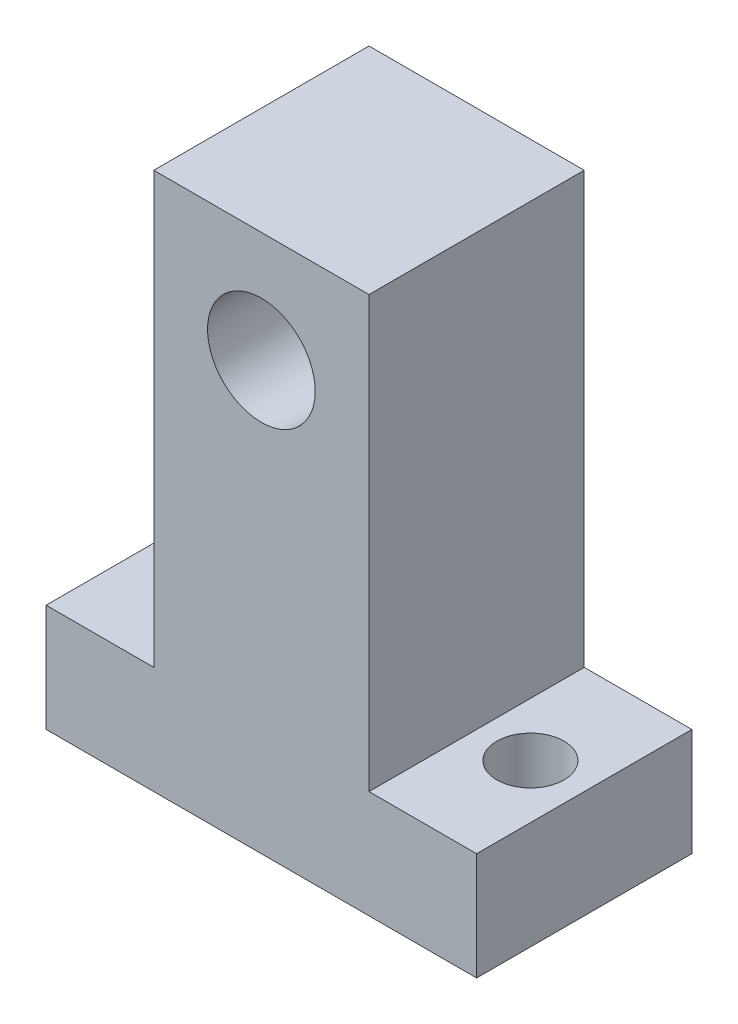
ISO-10303-21;
HEADER;
FILE_DESCRIPTION(('STEP AP214'),'2;1');
FILE_NAME('part.step','',(''),(''),'','','');
FILE_SCHEMA(('AUTOMOTIVE_DESIGN { 1 0 10303 214 1 1 1 1 }'));
ENDSEC;
DATA;
#1=APPLICATION_CONTEXT('core data for automotive mechanical design processes');
#2=APPLICATION_PROTOCOL_DEFINITION('international standard','automotive_design',2000,#1);
#3=PRODUCT_CONTEXT('',#1,'mechanical');
#4=PRODUCT('Part','Part','',(#3));
#5=PRODUCT_RELATED_PRODUCT_CATEGORY('part','',(#4));
#6=PRODUCT_DEFINITION_FORMATION('','',#4);
#7=PRODUCT_DEFINITION_CONTEXT('part definition',#1,'design');
#8=PRODUCT_DEFINITION('design','',#6,#7);
#9=PRODUCT_DEFINITION_SHAPE('','',#8);
#10=(LENGTH_UNIT() NAMED_UNIT(*) SI_UNIT(.MILLI.,.METRE.));
#11=(NAMED_UNIT(*) PLANE_ANGLE_UNIT() SI_UNIT($,.RADIAN.));
#12=(NAMED_UNIT(*) SI_UNIT($,.STERADIAN.) SOLID_ANGLE_UNIT());
#13=UNCERTAINTY_MEASURE_WITH_UNIT(LENGTH_MEASURE(1.E-05),#10,'distance_accuracy_value','');
#14=(GEOMETRIC_REPRESENTATION_CONTEXT(3) GLOBAL_UNCERTAINTY_ASSIGNED_CONTEXT((#13)) GLOBAL_UNIT_ASSIGNED_CONTEXT((#10,
#11,#12)) REPRESENTATION_CONTEXT('',''));
#15=CARTESIAN_POINT('',(0.,0.,0.));
#16=DIRECTION('',(0.,0.,1.));
#17=DIRECTION('',(1.,0.,0.));
#18=AXIS2_PLACEMENT_3D('',#15,#16,#17);
#19=CARTESIAN_POINT('',(0.,0.,16.));
#20=DIRECTION('',(0.,1.,0.));
#21=DIRECTION('',(0.,0.,1.));
#22=AXIS2_PLACEMENT_3D('',#19,#20,#21);
#23=PLANE('',#22);
#24=DIRECTION('',(1.,0.,0.));
#25=VECTOR('',#24,1.);
#26=CARTESIAN_POINT('',(0.,0.,0.));
#27=LINE('',#26,#25);
#28=CARTESIAN_POINT('',(-16.,0.,0.));
#29=VERTEX_POINT('',#28);
#30=CARTESIAN_POINT('',(16.,0.,0.));
#31=VERTEX_POINT('',#30);
#32=EDGE_CURVE('E88',#29,#31,#27,.T.);
#33=ORIENTED_EDGE('',*,*,#32,.T.);
#34=DIRECTION('',(0.,0.,-1.));
#35=VECTOR('',#34,1.);
#36=CARTESIAN_POINT('',(16.,0.,16.));
#37=LINE('',#36,#35);
#38=CARTESIAN_POINT('',(16.,0.,16.));
#39=VERTEX_POINT('',#38);
#40=EDGE_CURVE('E11',#39,#31,#37,.T.);
#41=ORIENTED_EDGE('',*,*,#40,.F.);
#42=DIRECTION('',(1.,0.,0.));
#43=VECTOR('',#42,1.);
#44=CARTESIAN_POINT('',(-16.,0.,16.));
#45=LINE('',#44,#43);
#46=CARTESIAN_POINT('',(-16.,0.,16.));
#47=VERTEX_POINT('',#46);
#48=EDGE_CURVE('E94',#47,#39,#45,.T.);
#49=ORIENTED_EDGE('',*,*,#48,.F.);
#50=DIRECTION('',(0.,0.,-1.));
#51=VECTOR('',#50,1.);
#52=CARTESIAN_POINT('',(-16.,0.,16.));
#53=LINE('',#52,#51);
#54=EDGE_CURVE('E128',#47,#29,#53,.T.);
#55=ORIENTED_EDGE('',*,*,#54,.T.);
#56=EDGE_LOOP('',(#33,#41,#49,#55));
#57=FACE_BOUND('',#56,.T.);
#58=CARTESIAN_POINT('',(12.,0.,8.));
#59=DIRECTION('',(0.,1.,0.));
#60=DIRECTION('',(-1.,0.,0.));
#61=AXIS2_PLACEMENT_3D('',#58,#59,#60);
#62=CIRCLE('',#61,2.5);
#63=CARTESIAN_POINT('',(9.5,0.,8.));
#64=VERTEX_POINT('',#63);
#65=EDGE_CURVE('E185',#64,#64,#62,.F.);
#66=ORIENTED_EDGE('',*,*,#65,.F.);
#67=EDGE_LOOP('',(#66));
#68=FACE_BOUND('',#67,.T.);
#69=CARTESIAN_POINT('',(-12.,0.,8.));
#70=DIRECTION('',(0.,1.,0.));
#71=DIRECTION('',(-1.,0.,0.));
#72=AXIS2_PLACEMENT_3D('',#69,#70,#71);
#73=CIRCLE('',#72,2.5);
#74=CARTESIAN_POINT('',(-14.5,0.,8.));
#75=VERTEX_POINT('',#74);
#76=EDGE_CURVE('E134',#75,#75,#73,.T.);
#77=ORIENTED_EDGE('',*,*,#76,.T.);
#78=EDGE_LOOP('',(#77));
#79=FACE_BOUND('',#78,.T.);
#80=ADVANCED_FACE('F35',(#57,#68,#79),#23,.F.);
#81=CARTESIAN_POINT('',(16.,0.,16.));
#82=DIRECTION('',(-1.,0.,0.));
#83=DIRECTION('',(0.,0.,1.));
#84=AXIS2_PLACEMENT_3D('',#81,#82,#83);
#85=PLANE('',#84);
#86=DIRECTION('',(0.,1.,0.));
#87=VECTOR('',#86,1.);
#88=CARTESIAN_POINT('',(16.,0.,0.));
#89=LINE('',#88,#87);
#90=CARTESIAN_POINT('',(16.,8.,0.));
#91=VERTEX_POINT('',#90);
#92=EDGE_CURVE('E133',#31,#91,#89,.T.);
#93=ORIENTED_EDGE('',*,*,#92,.T.);
#94=DIRECTION('',(0.,0.,-1.));
#95=VECTOR('',#94,1.);
#96=CARTESIAN_POINT('',(16.,8.,16.));
#97=LINE('',#96,#95);
#98=CARTESIAN_POINT('',(16.,8.,16.));
#99=VERTEX_POINT('',#98);
#100=EDGE_CURVE('E44',#99,#91,#97,.T.);
#101=ORIENTED_EDGE('',*,*,#100,.F.);
#102=DIRECTION('',(0.,1.,0.));
#103=VECTOR('',#102,1.);
#104=CARTESIAN_POINT('',(16.,0.,16.));
#105=LINE('',#104,#103);
#106=EDGE_CURVE('E179',#39,#99,#105,.T.);
#107=ORIENTED_EDGE('',*,*,#106,.F.);
#108=ORIENTED_EDGE('',*,*,#40,.T.);
#109=EDGE_LOOP('',(#93,#101,#107,#108));
#110=FACE_BOUND('',#109,.T.);
#111=ADVANCED_FACE('F213',(#110),#85,.F.);
#112=CARTESIAN_POINT('',(16.,8.,16.));
#113=DIRECTION('',(0.,-1.,0.));
#114=DIRECTION('',(1.,0.,0.));
#115=AXIS2_PLACEMENT_3D('',#112,#113,#114);
#116=PLANE('',#115);
#117=CARTESIAN_POINT('',(12.,8.00000000000001,8.));
#118=DIRECTION('',(0.,1.,0.));
#119=DIRECTION('',(-1.,0.,0.));
#120=AXIS2_PLACEMENT_3D('',#117,#118,#119);
#121=CIRCLE('',#120,2.5);
#122=CARTESIAN_POINT('',(9.5,8.00000000000001,8.));
#123=VERTEX_POINT('',#122);
#124=EDGE_CURVE('E182',#123,#123,#121,.F.);
#125=ORIENTED_EDGE('',*,*,#124,.T.);
#126=EDGE_LOOP('',(#125));
#127=FACE_BOUND('',#126,.T.);
#128=DIRECTION('',(-1.,0.,0.));
#129=VECTOR('',#128,1.);
#130=CARTESIAN_POINT('',(16.,8.,0.));
#131=LINE('',#130,#129);
#132=CARTESIAN_POINT('',(8.,8.,0.));
#133=VERTEX_POINT('',#132);
#134=EDGE_CURVE('E136',#91,#133,#131,.T.);
#135=ORIENTED_EDGE('',*,*,#134,.T.);
#136=DIRECTION('',(0.,0.,-1.));
#137=VECTOR('',#136,1.);
#138=CARTESIAN_POINT('',(8.,8.,16.));
#139=LINE('',#138,#137);
#140=CARTESIAN_POINT('',(8.,8.,16.));
#141=VERTEX_POINT('',#140);
#142=EDGE_CURVE('E153',#141,#133,#139,.T.);
#143=ORIENTED_EDGE('',*,*,#142,.F.);
#144=DIRECTION('',(-1.,0.,0.));
#145=VECTOR('',#144,1.);
#146=CARTESIAN_POINT('',(16.,8.,16.));
#147=LINE('',#146,#145);
#148=EDGE_CURVE('E163',#99,#141,#147,.T.);
#149=ORIENTED_EDGE('',*,*,#148,.F.);
#150=ORIENTED_EDGE('',*,*,#100,.T.);
#151=EDGE_LOOP('',(#135,#143,#149,#150));
#152=FACE_BOUND('',#151,.T.);
#153=ADVANCED_FACE('F161',(#127,#152),#116,.F.);
#154=CARTESIAN_POINT('',(8.,8.,16.));
#155=DIRECTION('',(-1.,0.,0.));
#156=DIRECTION('',(0.,0.,1.));
#157=AXIS2_PLACEMENT_3D('',#154,#155,#156);
#158=PLANE('',#157);
#159=DIRECTION('',(0.,1.,0.));
#160=VECTOR('',#159,1.);
#161=CARTESIAN_POINT('',(8.,8.,0.));
#162=LINE('',#161,#160);
#163=CARTESIAN_POINT('',(8.,40.,0.));
#164=VERTEX_POINT('',#163);
#165=EDGE_CURVE('E138',#133,#164,#162,.T.);
#166=ORIENTED_EDGE('',*,*,#165,.T.);
#167=DIRECTION('',(0.,0.,-1.));
#168=VECTOR('',#167,1.);
#169=CARTESIAN_POINT('',(8.,40.,16.));
#170=LINE('',#169,#168);
#171=CARTESIAN_POINT('',(8.,40.,16.));
#172=VERTEX_POINT('',#171);
#173=EDGE_CURVE('E150',#172,#164,#170,.T.);
#174=ORIENTED_EDGE('',*,*,#173,.F.);
#175=DIRECTION('',(0.,1.,0.));
#176=VECTOR('',#175,1.);
#177=CARTESIAN_POINT('',(8.,8.,16.));
#178=LINE('',#177,#176);
#179=EDGE_CURVE('E175',#141,#172,#178,.T.);
#180=ORIENTED_EDGE('',*,*,#179,.F.);
#181=ORIENTED_EDGE('',*,*,#142,.T.);
#182=EDGE_LOOP('',(#166,#174,#180,#181));
#183=FACE_BOUND('',#182,.T.);
#184=ADVANCED_FACE('F171',(#183),#158,.F.);
#185=CARTESIAN_POINT('',(8.,40.,16.));
#186=DIRECTION('',(0.,-1.,0.));
#187=DIRECTION('',(0.,0.,-1.));
#188=AXIS2_PLACEMENT_3D('',#185,#186,#187);
#189=PLANE('',#188);
#190=DIRECTION('',(-1.,0.,0.));
#191=VECTOR('',#190,1.);
#192=CARTESIAN_POINT('',(8.,40.,0.));
#193=LINE('',#192,#191);
#194=CARTESIAN_POINT('',(-8.,40.,0.));
#195=VERTEX_POINT('',#194);
#196=EDGE_CURVE('E140',#164,#195,#193,.T.);
#197=ORIENTED_EDGE('',*,*,#196,.T.);
#198=DIRECTION('',(0.,0.,-1.));
#199=VECTOR('',#198,1.);
#200=CARTESIAN_POINT('',(-8.,40.,16.));
#201=LINE('',#200,#199);
#202=CARTESIAN_POINT('',(-8.,40.,16.));
#203=VERTEX_POINT('',#202);
#204=EDGE_CURVE('E123',#203,#195,#201,.T.);
#205=ORIENTED_EDGE('',*,*,#204,.F.);
#206=DIRECTION('',(-1.,0.,0.));
#207=VECTOR('',#206,1.);
#208=CARTESIAN_POINT('',(8.,40.,16.));
#209=LINE('',#208,#207);
#210=EDGE_CURVE('E114',#172,#203,#209,.T.);
#211=ORIENTED_EDGE('',*,*,#210,.F.);
#212=ORIENTED_EDGE('',*,*,#173,.T.);
#213=EDGE_LOOP('',(#197,#205,#211,#212));
#214=FACE_BOUND('',#213,.T.);
#215=ADVANCED_FACE('F174',(#214),#189,.F.);
#216=CARTESIAN_POINT('',(-8.,40.,16.));
#217=DIRECTION('',(1.,0.,0.));
#218=DIRECTION('',(0.,1.,0.));
#219=AXIS2_PLACEMENT_3D('',#216,#217,#218);
#220=PLANE('',#219);
#221=DIRECTION('',(0.,-1.,0.));
#222=VECTOR('',#221,1.);
#223=CARTESIAN_POINT('',(-8.,40.,0.));
#224=LINE('',#223,#222);
#225=CARTESIAN_POINT('',(-8.,8.,0.));
#226=VERTEX_POINT('',#225);
#227=EDGE_CURVE('E122',#195,#226,#224,.T.);
#228=ORIENTED_EDGE('',*,*,#227,.T.);
#229=DIRECTION('',(0.,0.,-1.));
#230=VECTOR('',#229,1.);
#231=CARTESIAN_POINT('',(-8.,8.,16.));
#232=LINE('',#231,#230);
#233=CARTESIAN_POINT('',(-8.,8.,16.));
#234=VERTEX_POINT('',#233);
#235=EDGE_CURVE('E119',#234,#226,#232,.T.);
#236=ORIENTED_EDGE('',*,*,#235,.F.);
#237=DIRECTION('',(0.,-1.,0.));
#238=VECTOR('',#237,1.);
#239=CARTESIAN_POINT('',(-8.,40.,16.));
#240=LINE('',#239,#238);
#241=EDGE_CURVE('E108',#203,#234,#240,.T.);
#242=ORIENTED_EDGE('',*,*,#241,.F.);
#243=ORIENTED_EDGE('',*,*,#204,.T.);
#244=EDGE_LOOP('',(#228,#236,#242,#243));
#245=FACE_BOUND('',#244,.T.);
#246=ADVANCED_FACE('F120',(#245),#220,.F.);
#247=CARTESIAN_POINT('',(-8.,8.,16.));
#248=DIRECTION('',(0.,-1.,0.));
#249=DIRECTION('',(1.,0.,0.));
#250=AXIS2_PLACEMENT_3D('',#247,#248,#249);
#251=PLANE('',#250);
#252=CARTESIAN_POINT('',(-12.,8.,8.));
#253=DIRECTION('',(0.,1.,0.));
#254=DIRECTION('',(-1.,0.,0.));
#255=AXIS2_PLACEMENT_3D('',#252,#253,#254);
#256=CIRCLE('',#255,2.5);
#257=CARTESIAN_POINT('',(-14.5,8.,8.));
#258=VERTEX_POINT('',#257);
#259=EDGE_CURVE('E188',#258,#258,#256,.T.);
#260=ORIENTED_EDGE('',*,*,#259,.F.);
#261=EDGE_LOOP('',(#260));
#262=FACE_BOUND('',#261,.T.);
#263=DIRECTION('',(-1.,0.,0.));
#264=VECTOR('',#263,1.);
#265=CARTESIAN_POINT('',(-8.,8.,0.));
#266=LINE('',#265,#264);
#267=CARTESIAN_POINT('',(-16.,8.,0.));
#268=VERTEX_POINT('',#267);
#269=EDGE_CURVE('E81',#226,#268,#266,.T.);
#270=ORIENTED_EDGE('',*,*,#269,.T.);
#271=DIRECTION('',(0.,0.,-1.));
#272=VECTOR('',#271,1.);
#273=CARTESIAN_POINT('',(-16.,8.,16.));
#274=LINE('',#273,#272);
#275=CARTESIAN_POINT('',(-16.,8.,16.));
#276=VERTEX_POINT('',#275);
#277=EDGE_CURVE('E124',#276,#268,#274,.T.);
#278=ORIENTED_EDGE('',*,*,#277,.F.);
#279=DIRECTION('',(-1.,0.,0.));
#280=VECTOR('',#279,1.);
#281=CARTESIAN_POINT('',(-8.,8.,16.));
#282=LINE('',#281,#280);
#283=EDGE_CURVE('E112',#234,#276,#282,.T.);
#284=ORIENTED_EDGE('',*,*,#283,.F.);
#285=ORIENTED_EDGE('',*,*,#235,.T.);
#286=EDGE_LOOP('',(#270,#278,#284,#285));
#287=FACE_BOUND('',#286,.T.);
#288=ADVANCED_FACE('F126',(#262,#287),#251,.F.);
#289=CARTESIAN_POINT('',(-16.,8.,16.));
#290=DIRECTION('',(1.,0.,0.));
#291=DIRECTION('',(0.,0.,-1.));
#292=AXIS2_PLACEMENT_3D('',#289,#290,#291);
#293=PLANE('',#292);
#294=DIRECTION('',(0.,-1.,0.));
#295=VECTOR('',#294,1.);
#296=CARTESIAN_POINT('',(-16.,8.,0.));
#297=LINE('',#296,#295);
#298=EDGE_CURVE('E144',#268,#29,#297,.T.);
#299=ORIENTED_EDGE('',*,*,#298,.T.);
#300=ORIENTED_EDGE('',*,*,#54,.F.);
#301=DIRECTION('',(0.,-1.,0.));
#302=VECTOR('',#301,1.);
#303=CARTESIAN_POINT('',(-16.,8.,16.));
#304=LINE('',#303,#302);
#305=EDGE_CURVE('E52',#276,#47,#304,.T.);
#306=ORIENTED_EDGE('',*,*,#305,.F.);
#307=ORIENTED_EDGE('',*,*,#277,.T.);
#308=EDGE_LOOP('',(#299,#300,#306,#307));
#309=FACE_BOUND('',#308,.T.);
#310=ADVANCED_FACE('F228',(#309),#293,.F.);
#311=CARTESIAN_POINT('',(0.,0.,16.));
#312=DIRECTION('',(0.,0.,1.));
#313=DIRECTION('',(1.,0.,0.));
#314=AXIS2_PLACEMENT_3D('',#311,#312,#313);
#315=PLANE('',#314);
#316=CARTESIAN_POINT('',(0.,31.77,16.));
#317=DIRECTION('',(0.,0.,1.));
#318=DIRECTION('',(1.,0.,0.));
#319=AXIS2_PLACEMENT_3D('',#316,#317,#318);
#320=CIRCLE('',#319,4.);
#321=CARTESIAN_POINT('',(4.,31.77,16.));
#322=VERTEX_POINT('',#321);
#323=EDGE_CURVE('E193',#322,#322,#320,.T.);
#324=ORIENTED_EDGE('',*,*,#323,.F.);
#325=EDGE_LOOP('',(#324));
#326=FACE_BOUND('',#325,.T.);
#327=ORIENTED_EDGE('',*,*,#48,.T.);
#328=ORIENTED_EDGE('',*,*,#106,.T.);
#329=ORIENTED_EDGE('',*,*,#148,.T.);
#330=ORIENTED_EDGE('',*,*,#179,.T.);
#331=ORIENTED_EDGE('',*,*,#210,.T.);
#332=ORIENTED_EDGE('',*,*,#241,.T.);
#333=ORIENTED_EDGE('',*,*,#283,.T.);
#334=ORIENTED_EDGE('',*,*,#305,.T.);
#335=EDGE_LOOP('',(#327,#328,#329,#330,#331,#332,#333,#334));
#336=FACE_BOUND('',#335,.T.);
#337=ADVANCED_FACE('F110',(#326,#336),#315,.T.);
#338=CARTESIAN_POINT('',(0.,0.,0.));
#339=DIRECTION('',(0.,0.,1.));
#340=DIRECTION('',(1.,0.,0.));
#341=AXIS2_PLACEMENT_3D('',#338,#339,#340);
#342=PLANE('',#341);
#343=CARTESIAN_POINT('',(0.,31.77,0.));
#344=DIRECTION('',(0.,0.,1.));
#345=DIRECTION('',(1.,0.,0.));
#346=AXIS2_PLACEMENT_3D('',#343,#344,#345);
#347=CIRCLE('',#346,4.);
#348=CARTESIAN_POINT('',(4.,31.77,0.));
#349=VERTEX_POINT('',#348);
#350=EDGE_CURVE('E38',#349,#349,#347,.T.);
#351=ORIENTED_EDGE('',*,*,#350,.T.);
#352=EDGE_LOOP('',(#351));
#353=FACE_BOUND('',#352,.T.);
#354=ORIENTED_EDGE('',*,*,#32,.F.);
#355=ORIENTED_EDGE('',*,*,#298,.F.);
#356=ORIENTED_EDGE('',*,*,#269,.F.);
#357=ORIENTED_EDGE('',*,*,#227,.F.);
#358=ORIENTED_EDGE('',*,*,#196,.F.);
#359=ORIENTED_EDGE('',*,*,#165,.F.);
#360=ORIENTED_EDGE('',*,*,#134,.F.);
#361=ORIENTED_EDGE('',*,*,#92,.F.);
#362=EDGE_LOOP('',(#354,#355,#356,#357,#358,#359,#360,#361));
#363=FACE_BOUND('',#362,.T.);
#364=ADVANCED_FACE('F167',(#353,#363),#342,.F.);
#365=CARTESIAN_POINT('',(-12.,0.,8.));
#366=DIRECTION('',(0.,1.,0.));
#367=DIRECTION('',(-1.,0.,0.));
#368=AXIS2_PLACEMENT_3D('',#365,#366,#367);
#369=CYLINDRICAL_SURFACE('',#368,2.5);
#370=ORIENTED_EDGE('',*,*,#76,.F.);
#371=EDGE_LOOP('',(#370));
#372=FACE_BOUND('',#371,.T.);
#373=ORIENTED_EDGE('',*,*,#259,.T.);
#374=EDGE_LOOP('',(#373));
#375=FACE_BOUND('',#374,.T.);
#376=ADVANCED_FACE('F208',(#372,#375),#369,.F.);
#377=CARTESIAN_POINT('',(12.,0.,8.));
#378=DIRECTION('',(0.,1.,0.));
#379=DIRECTION('',(-1.,0.,0.));
#380=AXIS2_PLACEMENT_3D('',#377,#378,#379);
#381=CYLINDRICAL_SURFACE('',#380,2.5);
#382=ORIENTED_EDGE('',*,*,#65,.T.);
#383=EDGE_LOOP('',(#382));
#384=FACE_BOUND('',#383,.T.);
#385=ORIENTED_EDGE('',*,*,#124,.F.);
#386=EDGE_LOOP('',(#385));
#387=FACE_BOUND('',#386,.T.);
#388=ADVANCED_FACE('F203',(#384,#387),#381,.F.);
#389=CARTESIAN_POINT('',(0.,31.77,-13.));
#390=DIRECTION('',(0.,0.,1.));
#391=DIRECTION('',(1.,0.,0.));
#392=AXIS2_PLACEMENT_3D('',#389,#390,#391);
#393=CYLINDRICAL_SURFACE('',#392,4.);
#394=ORIENTED_EDGE('',*,*,#323,.T.);
#395=EDGE_LOOP('',(#394));
#396=FACE_BOUND('',#395,.T.);
#397=ORIENTED_EDGE('',*,*,#350,.F.);
#398=EDGE_LOOP('',(#397));
#399=FACE_BOUND('',#398,.T.);
#400=ADVANCED_FACE('F201',(#396,#399),#393,.F.);
#401=CLOSED_SHELL('',(#80,#111,#153,#184,#215,#246,#288,#310,#337,#364,#376,#388,#400));
#402=MANIFOLD_SOLID_BREP('B2',#401);
#403=ADVANCED_BREP_SHAPE_REPRESENTATION('',(#18,#402),#14);
#404=SHAPE_DEFINITION_REPRESENTATION(#9,#403);
ENDSEC;
END-ISO-10303-21;
